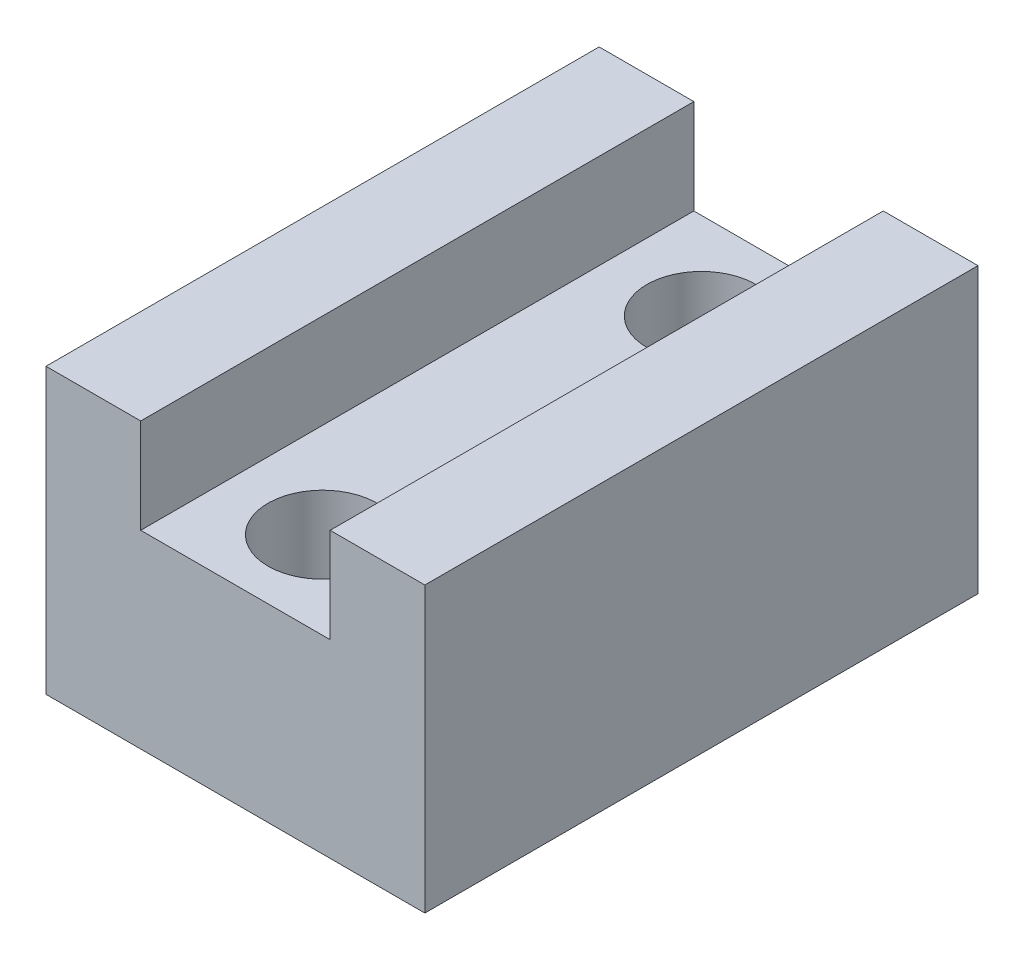
ISO-10303-21;
HEADER;
FILE_DESCRIPTION(('STEP AP214'),'2;1');
FILE_NAME('part.step','',(''),(''),'','','');
FILE_SCHEMA(('AUTOMOTIVE_DESIGN { 1 0 10303 214 1 1 1 1 }'));
ENDSEC;
DATA;
#1=APPLICATION_CONTEXT('core data for automotive mechanical design processes');
#2=APPLICATION_PROTOCOL_DEFINITION('international standard','automotive_design',2000,#1);
#3=PRODUCT_CONTEXT('',#1,'mechanical');
#4=PRODUCT('Part','Part','',(#3));
#5=PRODUCT_RELATED_PRODUCT_CATEGORY('part','',(#4));
#6=PRODUCT_DEFINITION_FORMATION('','',#4);
#7=PRODUCT_DEFINITION_CONTEXT('part definition',#1,'design');
#8=PRODUCT_DEFINITION('design','',#6,#7);
#9=PRODUCT_DEFINITION_SHAPE('','',#8);
#10=(LENGTH_UNIT() NAMED_UNIT(*) SI_UNIT(.MILLI.,.METRE.));
#11=(NAMED_UNIT(*) PLANE_ANGLE_UNIT() SI_UNIT($,.RADIAN.));
#12=(NAMED_UNIT(*) SI_UNIT($,.STERADIAN.) SOLID_ANGLE_UNIT());
#13=UNCERTAINTY_MEASURE_WITH_UNIT(LENGTH_MEASURE(1.E-05),#10,'distance_accuracy_value','');
#14=(GEOMETRIC_REPRESENTATION_CONTEXT(3) GLOBAL_UNCERTAINTY_ASSIGNED_CONTEXT((#13)) GLOBAL_UNIT_ASSIGNED_CONTEXT((#10,
#11,#12)) REPRESENTATION_CONTEXT('',''));
#15=CARTESIAN_POINT('',(0.,0.,0.));
#16=DIRECTION('',(0.,0.,1.));
#17=DIRECTION('',(1.,0.,0.));
#18=AXIS2_PLACEMENT_3D('',#15,#16,#17);
#19=CARTESIAN_POINT('',(-42.926,205.354335674275,-80.9624999999999));
#20=DIRECTION('',(0.,-1.,0.));
#21=DIRECTION('',(0.,0.,-1.));
#22=AXIS2_PLACEMENT_3D('',#19,#20,#21);
#23=CYLINDRICAL_SURFACE('',#22,1.82879999999993);
#24=CARTESIAN_POINT('',(-42.926,173.355,-80.9624999999999));
#25=DIRECTION('',(0.,1.,0.));
#26=DIRECTION('',(0.,0.,1.));
#27=AXIS2_PLACEMENT_3D('',#24,#25,#26);
#28=CIRCLE('',#27,1.82879999999993);
#29=CARTESIAN_POINT('',(-42.926,173.355,-79.1337));
#30=VERTEX_POINT('',#29);
#31=EDGE_CURVE('E159',#30,#30,#28,.T.);
#32=ORIENTED_EDGE('',*,*,#31,.F.);
#33=EDGE_LOOP('',(#32));
#34=FACE_BOUND('',#33,.T.);
#35=CARTESIAN_POINT('',(-42.926,179.705,-80.9624999999999));
#36=DIRECTION('',(0.,1.,0.));
#37=DIRECTION('',(0.,0.,1.));
#38=AXIS2_PLACEMENT_3D('',#35,#36,#37);
#39=CIRCLE('',#38,1.8288);
#40=CARTESIAN_POINT('',(-42.926,179.705,-79.1336999999999));
#41=VERTEX_POINT('',#40);
#42=EDGE_CURVE('E323',#41,#41,#39,.T.);
#43=ORIENTED_EDGE('',*,*,#42,.T.);
#44=EDGE_LOOP('',(#43));
#45=FACE_BOUND('',#44,.T.);
#46=ADVANCED_FACE('F41',(#34,#45),#23,.F.);
#47=CARTESIAN_POINT('',(-42.926,205.354335674275,-68.2625));
#48=DIRECTION('',(0.,-1.,0.));
#49=DIRECTION('',(0.,0.,-1.));
#50=AXIS2_PLACEMENT_3D('',#47,#48,#49);
#51=CYLINDRICAL_SURFACE('',#50,1.82879999999993);
#52=CARTESIAN_POINT('',(-42.926,173.355,-68.2625));
#53=DIRECTION('',(0.,1.,0.));
#54=DIRECTION('',(0.,0.,1.));
#55=AXIS2_PLACEMENT_3D('',#52,#53,#54);
#56=CIRCLE('',#55,1.82879999999993);
#57=CARTESIAN_POINT('',(-42.926,173.355,-66.4337000000001));
#58=VERTEX_POINT('',#57);
#59=EDGE_CURVE('E156',#58,#58,#56,.T.);
#60=ORIENTED_EDGE('',*,*,#59,.F.);
#61=EDGE_LOOP('',(#60));
#62=FACE_BOUND('',#61,.T.);
#63=CARTESIAN_POINT('',(-42.926,179.705,-68.2625));
#64=DIRECTION('',(0.,1.,0.));
#65=DIRECTION('',(0.,0.,1.));
#66=AXIS2_PLACEMENT_3D('',#63,#64,#65);
#67=CIRCLE('',#66,1.8288);
#68=CARTESIAN_POINT('',(-42.926,179.705,-66.4337));
#69=VERTEX_POINT('',#68);
#70=EDGE_CURVE('E135',#69,#69,#67,.T.);
#71=ORIENTED_EDGE('',*,*,#70,.T.);
#72=EDGE_LOOP('',(#71));
#73=FACE_BOUND('',#72,.T.);
#74=ADVANCED_FACE('F203',(#62,#73),#51,.F.);
#75=CARTESIAN_POINT('',(0.,182.88,0.));
#76=DIRECTION('',(0.,1.,0.));
#77=DIRECTION('',(0.,0.,1.));
#78=AXIS2_PLACEMENT_3D('',#75,#76,#77);
#79=PLANE('',#78);
#80=DIRECTION('',(0.,0.,1.));
#81=VECTOR('',#80,1.);
#82=CARTESIAN_POINT('',(-46.101,182.88,-65.3415));
#83=LINE('',#82,#81);
#84=CARTESIAN_POINT('',(-46.101,182.88,-83.8834999999999));
#85=VERTEX_POINT('',#84);
#86=CARTESIAN_POINT('',(-46.101,182.88,-65.3415));
#87=VERTEX_POINT('',#86);
#88=EDGE_CURVE('E111',#85,#87,#83,.T.);
#89=ORIENTED_EDGE('',*,*,#88,.F.);
#90=DIRECTION('',(-1.,0.,0.));
#91=VECTOR('',#90,1.);
#92=CARTESIAN_POINT('',(-49.276,182.88,-83.8834999999999));
#93=LINE('',#92,#91);
#94=CARTESIAN_POINT('',(-49.276,182.88,-83.8834999999999));
#95=VERTEX_POINT('',#94);
#96=EDGE_CURVE('E149',#85,#95,#93,.T.);
#97=ORIENTED_EDGE('',*,*,#96,.T.);
#98=DIRECTION('',(0.,0.,1.));
#99=VECTOR('',#98,1.);
#100=CARTESIAN_POINT('',(-49.276,182.88,-65.3415));
#101=LINE('',#100,#99);
#102=CARTESIAN_POINT('',(-49.276,182.88,-65.3415));
#103=VERTEX_POINT('',#102);
#104=EDGE_CURVE('E146',#95,#103,#101,.T.);
#105=ORIENTED_EDGE('',*,*,#104,.T.);
#106=DIRECTION('',(1.,0.,0.));
#107=VECTOR('',#106,1.);
#108=CARTESIAN_POINT('',(-49.276,182.88,-65.3415));
#109=LINE('',#108,#107);
#110=EDGE_CURVE('E144',#103,#87,#109,.T.);
#111=ORIENTED_EDGE('',*,*,#110,.T.);
#112=EDGE_LOOP('',(#89,#97,#105,#111));
#113=FACE_BOUND('',#112,.T.);
#114=ADVANCED_FACE('F191',(#113),#79,.T.);
#115=CARTESIAN_POINT('',(-49.276,205.354335674275,-65.3415));
#116=DIRECTION('',(0.,0.,-1.));
#117=DIRECTION('',(-1.,0.,0.));
#118=AXIS2_PLACEMENT_3D('',#115,#116,#117);
#119=PLANE('',#118);
#120=DIRECTION('',(1.,0.,0.));
#121=VECTOR('',#120,1.);
#122=CARTESIAN_POINT('',(-39.751,179.705,-65.3415));
#123=LINE('',#122,#121);
#124=CARTESIAN_POINT('',(-46.101,179.705,-65.3415));
#125=VERTEX_POINT('',#124);
#126=CARTESIAN_POINT('',(-39.751,179.705,-65.3415));
#127=VERTEX_POINT('',#126);
#128=EDGE_CURVE('E121',#125,#127,#123,.T.);
#129=ORIENTED_EDGE('',*,*,#128,.F.);
#130=DIRECTION('',(0.,1.,0.));
#131=VECTOR('',#130,1.);
#132=CARTESIAN_POINT('',(-46.101,179.705,-65.3415));
#133=LINE('',#132,#131);
#134=EDGE_CURVE('E105',#125,#87,#133,.T.);
#135=ORIENTED_EDGE('',*,*,#134,.T.);
#136=ORIENTED_EDGE('',*,*,#110,.F.);
#137=DIRECTION('',(0.,-1.,0.));
#138=VECTOR('',#137,1.);
#139=CARTESIAN_POINT('',(-49.276,205.354335674275,-65.3415));
#140=LINE('',#139,#138);
#141=CARTESIAN_POINT('',(-49.276,173.355,-65.3415));
#142=VERTEX_POINT('',#141);
#143=EDGE_CURVE('E64',#103,#142,#140,.T.);
#144=ORIENTED_EDGE('',*,*,#143,.T.);
#145=DIRECTION('',(1.,0.,0.));
#146=VECTOR('',#145,1.);
#147=CARTESIAN_POINT('',(-49.276,173.355,-65.3415));
#148=LINE('',#147,#146);
#149=CARTESIAN_POINT('',(-36.576,173.355,-65.3415));
#150=VERTEX_POINT('',#149);
#151=EDGE_CURVE('E170',#142,#150,#148,.T.);
#152=ORIENTED_EDGE('',*,*,#151,.T.);
#153=DIRECTION('',(0.,-1.,0.));
#154=VECTOR('',#153,1.);
#155=CARTESIAN_POINT('',(-36.576,205.354335674275,-65.3415));
#156=LINE('',#155,#154);
#157=CARTESIAN_POINT('',(-36.576,182.88,-65.3415));
#158=VERTEX_POINT('',#157);
#159=EDGE_CURVE('E173',#158,#150,#156,.T.);
#160=ORIENTED_EDGE('',*,*,#159,.F.);
#161=CARTESIAN_POINT('',(-39.751,182.88,-65.3415));
#162=VERTEX_POINT('',#161);
#163=EDGE_CURVE('E139',#162,#158,#109,.T.);
#164=ORIENTED_EDGE('',*,*,#163,.F.);
#165=DIRECTION('',(0.,1.,0.));
#166=VECTOR('',#165,1.);
#167=CARTESIAN_POINT('',(-39.751,179.705,-65.3415));
#168=LINE('',#167,#166);
#169=EDGE_CURVE('E56',#127,#162,#168,.T.);
#170=ORIENTED_EDGE('',*,*,#169,.F.);
#171=EDGE_LOOP('',(#129,#135,#136,#144,#152,#160,#164,#170));
#172=FACE_BOUND('',#171,.T.);
#173=ADVANCED_FACE('F126',(#172),#119,.F.);
#174=CARTESIAN_POINT('',(-49.276,205.354335674275,-65.3415));
#175=DIRECTION('',(1.,0.,0.));
#176=DIRECTION('',(0.,0.,-1.));
#177=AXIS2_PLACEMENT_3D('',#174,#175,#176);
#178=PLANE('',#177);
#179=ORIENTED_EDGE('',*,*,#104,.F.);
#180=DIRECTION('',(0.,-1.,0.));
#181=VECTOR('',#180,1.);
#182=CARTESIAN_POINT('',(-49.276,205.354335674275,-83.8834999999999));
#183=LINE('',#182,#181);
#184=CARTESIAN_POINT('',(-49.276,173.355,-83.8834999999999));
#185=VERTEX_POINT('',#184);
#186=EDGE_CURVE('E49',#95,#185,#183,.T.);
#187=ORIENTED_EDGE('',*,*,#186,.T.);
#188=DIRECTION('',(0.,0.,1.));
#189=VECTOR('',#188,1.);
#190=CARTESIAN_POINT('',(-49.276,173.355,-65.3415));
#191=LINE('',#190,#189);
#192=EDGE_CURVE('E168',#185,#142,#191,.T.);
#193=ORIENTED_EDGE('',*,*,#192,.T.);
#194=ORIENTED_EDGE('',*,*,#143,.F.);
#195=EDGE_LOOP('',(#179,#187,#193,#194));
#196=FACE_BOUND('',#195,.T.);
#197=ADVANCED_FACE('F176',(#196),#178,.F.);
#198=CARTESIAN_POINT('',(-49.276,205.354335674275,-83.8834999999999));
#199=DIRECTION('',(0.,0.,1.));
#200=DIRECTION('',(1.,0.,0.));
#201=AXIS2_PLACEMENT_3D('',#198,#199,#200);
#202=PLANE('',#201);
#203=ORIENTED_EDGE('',*,*,#96,.F.);
#204=DIRECTION('',(0.,1.,0.));
#205=VECTOR('',#204,1.);
#206=CARTESIAN_POINT('',(-46.101,179.705,-83.8834999999999));
#207=LINE('',#206,#205);
#208=CARTESIAN_POINT('',(-46.101,179.705,-83.8834999999999));
#209=VERTEX_POINT('',#208);
#210=EDGE_CURVE('E137',#209,#85,#207,.T.);
#211=ORIENTED_EDGE('',*,*,#210,.F.);
#212=DIRECTION('',(-1.,0.,0.));
#213=VECTOR('',#212,1.);
#214=CARTESIAN_POINT('',(-39.751,179.705,-83.8834999999999));
#215=LINE('',#214,#213);
#216=CARTESIAN_POINT('',(-39.751,179.705,-83.8834999999999));
#217=VERTEX_POINT('',#216);
#218=EDGE_CURVE('E115',#217,#209,#215,.T.);
#219=ORIENTED_EDGE('',*,*,#218,.F.);
#220=DIRECTION('',(0.,1.,0.));
#221=VECTOR('',#220,1.);
#222=CARTESIAN_POINT('',(-39.751,179.705,-83.8834999999999));
#223=LINE('',#222,#221);
#224=CARTESIAN_POINT('',(-39.751,182.88,-83.8834999999999));
#225=VERTEX_POINT('',#224);
#226=EDGE_CURVE('E140',#217,#225,#223,.T.);
#227=ORIENTED_EDGE('',*,*,#226,.T.);
#228=CARTESIAN_POINT('',(-36.576,182.88,-83.8834999999999));
#229=VERTEX_POINT('',#228);
#230=EDGE_CURVE('E150',#229,#225,#93,.T.);
#231=ORIENTED_EDGE('',*,*,#230,.F.);
#232=DIRECTION('',(0.,-1.,0.));
#233=VECTOR('',#232,1.);
#234=CARTESIAN_POINT('',(-36.576,205.354335674275,-83.8834999999999));
#235=LINE('',#234,#233);
#236=CARTESIAN_POINT('',(-36.576,173.355,-83.8834999999999));
#237=VERTEX_POINT('',#236);
#238=EDGE_CURVE('E11',#229,#237,#235,.T.);
#239=ORIENTED_EDGE('',*,*,#238,.T.);
#240=DIRECTION('',(-1.,0.,0.));
#241=VECTOR('',#240,1.);
#242=CARTESIAN_POINT('',(-49.276,173.355,-83.8834999999999));
#243=LINE('',#242,#241);
#244=EDGE_CURVE('E165',#237,#185,#243,.T.);
#245=ORIENTED_EDGE('',*,*,#244,.T.);
#246=ORIENTED_EDGE('',*,*,#186,.F.);
#247=EDGE_LOOP('',(#203,#211,#219,#227,#231,#239,#245,#246));
#248=FACE_BOUND('',#247,.T.);
#249=ADVANCED_FACE('F182',(#248),#202,.F.);
#250=CARTESIAN_POINT('',(-36.576,205.354335674275,-65.3415));
#251=DIRECTION('',(-1.,0.,0.));
#252=DIRECTION('',(0.,0.,1.));
#253=AXIS2_PLACEMENT_3D('',#250,#251,#252);
#254=PLANE('',#253);
#255=DIRECTION('',(0.,0.,-1.));
#256=VECTOR('',#255,1.);
#257=CARTESIAN_POINT('',(-36.576,182.88,-65.3415));
#258=LINE('',#257,#256);
#259=EDGE_CURVE('E153',#158,#229,#258,.T.);
#260=ORIENTED_EDGE('',*,*,#259,.F.);
#261=ORIENTED_EDGE('',*,*,#159,.T.);
#262=DIRECTION('',(0.,0.,-1.));
#263=VECTOR('',#262,1.);
#264=CARTESIAN_POINT('',(-36.576,173.355,-65.3415));
#265=LINE('',#264,#263);
#266=EDGE_CURVE('E162',#150,#237,#265,.T.);
#267=ORIENTED_EDGE('',*,*,#266,.T.);
#268=ORIENTED_EDGE('',*,*,#238,.F.);
#269=EDGE_LOOP('',(#260,#261,#267,#268));
#270=FACE_BOUND('',#269,.T.);
#271=ADVANCED_FACE('F43',(#270),#254,.F.);
#272=CARTESIAN_POINT('',(0.,173.355,0.));
#273=DIRECTION('',(0.,-1.,0.));
#274=DIRECTION('',(0.,0.,-1.));
#275=AXIS2_PLACEMENT_3D('',#272,#273,#274);
#276=PLANE('',#275);
#277=ORIENTED_EDGE('',*,*,#31,.T.);
#278=EDGE_LOOP('',(#277));
#279=FACE_BOUND('',#278,.T.);
#280=ORIENTED_EDGE('',*,*,#266,.F.);
#281=ORIENTED_EDGE('',*,*,#151,.F.);
#282=ORIENTED_EDGE('',*,*,#192,.F.);
#283=ORIENTED_EDGE('',*,*,#244,.F.);
#284=EDGE_LOOP('',(#280,#281,#282,#283));
#285=FACE_BOUND('',#284,.T.);
#286=ORIENTED_EDGE('',*,*,#59,.T.);
#287=EDGE_LOOP('',(#286));
#288=FACE_BOUND('',#287,.T.);
#289=ADVANCED_FACE('F186',(#279,#285,#288),#276,.T.);
#290=DIRECTION('',(0.,0.,-1.));
#291=VECTOR('',#290,1.);
#292=CARTESIAN_POINT('',(-39.751,182.88,-65.3415));
#293=LINE('',#292,#291);
#294=EDGE_CURVE('E124',#162,#225,#293,.T.);
#295=ORIENTED_EDGE('',*,*,#294,.F.);
#296=ORIENTED_EDGE('',*,*,#163,.T.);
#297=ORIENTED_EDGE('',*,*,#259,.T.);
#298=ORIENTED_EDGE('',*,*,#230,.T.);
#299=EDGE_LOOP('',(#295,#296,#297,#298));
#300=FACE_BOUND('',#299,.T.);
#301=ADVANCED_FACE('F193',(#300),#79,.T.);
#302=CARTESIAN_POINT('',(-46.101,179.705,-65.3415));
#303=DIRECTION('',(-1.,0.,0.));
#304=DIRECTION('',(0.,0.,1.));
#305=AXIS2_PLACEMENT_3D('',#302,#303,#304);
#306=PLANE('',#305);
#307=ORIENTED_EDGE('',*,*,#88,.T.);
#308=ORIENTED_EDGE('',*,*,#134,.F.);
#309=DIRECTION('',(0.,0.,1.));
#310=VECTOR('',#309,1.);
#311=CARTESIAN_POINT('',(-46.101,179.705,-65.3415));
#312=LINE('',#311,#310);
#313=EDGE_CURVE('E108',#209,#125,#312,.T.);
#314=ORIENTED_EDGE('',*,*,#313,.F.);
#315=ORIENTED_EDGE('',*,*,#210,.T.);
#316=EDGE_LOOP('',(#307,#308,#314,#315));
#317=FACE_BOUND('',#316,.T.);
#318=ADVANCED_FACE('F107',(#317),#306,.F.);
#319=CARTESIAN_POINT('',(-39.751,179.705,-65.3415));
#320=DIRECTION('',(1.,0.,0.));
#321=DIRECTION('',(0.,0.,-1.));
#322=AXIS2_PLACEMENT_3D('',#319,#320,#321);
#323=PLANE('',#322);
#324=ORIENTED_EDGE('',*,*,#294,.T.);
#325=ORIENTED_EDGE('',*,*,#226,.F.);
#326=DIRECTION('',(0.,0.,-1.));
#327=VECTOR('',#326,1.);
#328=CARTESIAN_POINT('',(-39.751,179.705,-65.3415));
#329=LINE('',#328,#327);
#330=EDGE_CURVE('E128',#127,#217,#329,.T.);
#331=ORIENTED_EDGE('',*,*,#330,.F.);
#332=ORIENTED_EDGE('',*,*,#169,.T.);
#333=EDGE_LOOP('',(#324,#325,#331,#332));
#334=FACE_BOUND('',#333,.T.);
#335=ADVANCED_FACE('F261',(#334),#323,.F.);
#336=CARTESIAN_POINT('',(0.,179.705,0.));
#337=DIRECTION('',(0.,1.,0.));
#338=DIRECTION('',(0.,0.,1.));
#339=AXIS2_PLACEMENT_3D('',#336,#337,#338);
#340=PLANE('',#339);
#341=ORIENTED_EDGE('',*,*,#42,.F.);
#342=EDGE_LOOP('',(#341));
#343=FACE_BOUND('',#342,.T.);
#344=ORIENTED_EDGE('',*,*,#70,.F.);
#345=EDGE_LOOP('',(#344));
#346=FACE_BOUND('',#345,.T.);
#347=ORIENTED_EDGE('',*,*,#313,.T.);
#348=ORIENTED_EDGE('',*,*,#128,.T.);
#349=ORIENTED_EDGE('',*,*,#330,.T.);
#350=ORIENTED_EDGE('',*,*,#218,.T.);
#351=EDGE_LOOP('',(#347,#348,#349,#350));
#352=FACE_BOUND('',#351,.T.);
#353=ADVANCED_FACE('F119',(#343,#346,#352),#340,.T.);
#354=CLOSED_SHELL('',(#46,#74,#114,#173,#197,#249,#271,#289,#301,#318,#335,#353));
#355=MANIFOLD_SOLID_BREP('B2',#354);
#356=ADVANCED_BREP_SHAPE_REPRESENTATION('',(#18,#355),#14);
#357=SHAPE_DEFINITION_REPRESENTATION(#9,#356);
ENDSEC;
END-ISO-10303-21;
